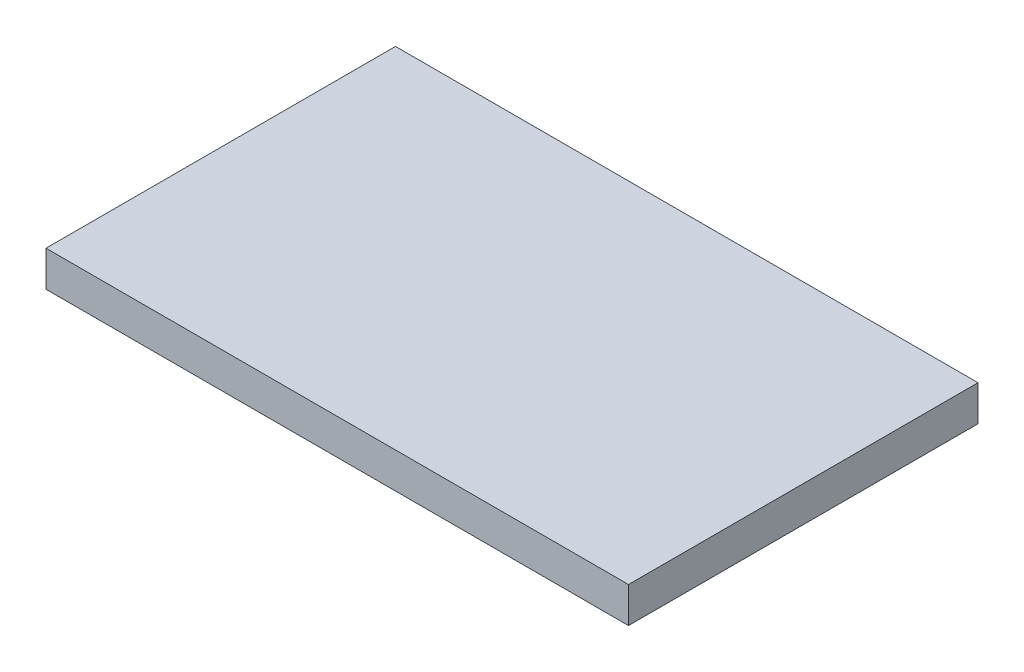
ISO-10303-21;
HEADER;
FILE_DESCRIPTION(('STEP AP214'),'2;1');
FILE_NAME('part.step','',(''),(''),'','','');
FILE_SCHEMA(('AUTOMOTIVE_DESIGN { 1 0 10303 214 1 1 1 1 }'));
ENDSEC;
DATA;
#1=APPLICATION_CONTEXT('core data for automotive mechanical design processes');
#2=APPLICATION_PROTOCOL_DEFINITION('international standard','automotive_design',2000,#1);
#3=PRODUCT_CONTEXT('',#1,'mechanical');
#4=PRODUCT('Part','Part','',(#3));
#5=PRODUCT_RELATED_PRODUCT_CATEGORY('part','',(#4));
#6=PRODUCT_DEFINITION_FORMATION('','',#4);
#7=PRODUCT_DEFINITION_CONTEXT('part definition',#1,'design');
#8=PRODUCT_DEFINITION('design','',#6,#7);
#9=PRODUCT_DEFINITION_SHAPE('','',#8);
#10=(LENGTH_UNIT() NAMED_UNIT(*) SI_UNIT(.MILLI.,.METRE.));
#11=(NAMED_UNIT(*) PLANE_ANGLE_UNIT() SI_UNIT($,.RADIAN.));
#12=(NAMED_UNIT(*) SI_UNIT($,.STERADIAN.) SOLID_ANGLE_UNIT());
#13=UNCERTAINTY_MEASURE_WITH_UNIT(LENGTH_MEASURE(1.E-05),#10,'distance_accuracy_value','');
#14=(GEOMETRIC_REPRESENTATION_CONTEXT(3) GLOBAL_UNCERTAINTY_ASSIGNED_CONTEXT((#13)) GLOBAL_UNIT_ASSIGNED_CONTEXT((#10,
#11,#12)) REPRESENTATION_CONTEXT('',''));
#15=CARTESIAN_POINT('',(0.,0.,0.));
#16=DIRECTION('',(0.,0.,1.));
#17=DIRECTION('',(1.,0.,0.));
#18=AXIS2_PLACEMENT_3D('',#15,#16,#17);
#19=CARTESIAN_POINT('',(16.375,2.,-9.825));
#20=DIRECTION('',(-1.,0.,0.));
#21=DIRECTION('',(0.,0.,1.));
#22=AXIS2_PLACEMENT_3D('',#19,#20,#21);
#23=PLANE('',#22);
#24=DIRECTION('',(0.,0.,-1.));
#25=VECTOR('',#24,1.);
#26=CARTESIAN_POINT('',(16.375,0.,-9.825));
#27=LINE('',#26,#25);
#28=CARTESIAN_POINT('',(16.375,0.,9.825));
#29=VERTEX_POINT('',#28);
#30=CARTESIAN_POINT('',(16.375,0.,-9.825));
#31=VERTEX_POINT('',#30);
#32=EDGE_CURVE('E96',#29,#31,#27,.T.);
#33=ORIENTED_EDGE('',*,*,#32,.T.);
#34=DIRECTION('',(0.,-1.,0.));
#35=VECTOR('',#34,1.);
#36=CARTESIAN_POINT('',(16.375,2.,-9.825));
#37=LINE('',#36,#35);
#38=CARTESIAN_POINT('',(16.375,2.,-9.825));
#39=VERTEX_POINT('',#38);
#40=EDGE_CURVE('E11',#39,#31,#37,.T.);
#41=ORIENTED_EDGE('',*,*,#40,.F.);
#42=DIRECTION('',(0.,0.,-1.));
#43=VECTOR('',#42,1.);
#44=CARTESIAN_POINT('',(16.375,2.,-9.825));
#45=LINE('',#44,#43);
#46=CARTESIAN_POINT('',(16.375,2.,9.825));
#47=VERTEX_POINT('',#46);
#48=EDGE_CURVE('E84',#47,#39,#45,.T.);
#49=ORIENTED_EDGE('',*,*,#48,.F.);
#50=DIRECTION('',(0.,-1.,0.));
#51=VECTOR('',#50,1.);
#52=CARTESIAN_POINT('',(16.375,2.,9.825));
#53=LINE('',#52,#51);
#54=EDGE_CURVE('E92',#47,#29,#53,.T.);
#55=ORIENTED_EDGE('',*,*,#54,.T.);
#56=EDGE_LOOP('',(#33,#41,#49,#55));
#57=FACE_BOUND('',#56,.T.);
#58=ADVANCED_FACE('F33',(#57),#23,.F.);
#59=CARTESIAN_POINT('',(-16.375,2.,-9.825));
#60=DIRECTION('',(0.,0.,1.));
#61=DIRECTION('',(1.,0.,0.));
#62=AXIS2_PLACEMENT_3D('',#59,#60,#61);
#63=PLANE('',#62);
#64=DIRECTION('',(-1.,0.,0.));
#65=VECTOR('',#64,1.);
#66=CARTESIAN_POINT('',(-16.375,0.,-9.825));
#67=LINE('',#66,#65);
#68=CARTESIAN_POINT('',(-16.375,0.,-9.825));
#69=VERTEX_POINT('',#68);
#70=EDGE_CURVE('E88',#31,#69,#67,.T.);
#71=ORIENTED_EDGE('',*,*,#70,.T.);
#72=DIRECTION('',(0.,-1.,0.));
#73=VECTOR('',#72,1.);
#74=CARTESIAN_POINT('',(-16.375,2.,-9.825));
#75=LINE('',#74,#73);
#76=CARTESIAN_POINT('',(-16.375,2.,-9.825));
#77=VERTEX_POINT('',#76);
#78=EDGE_CURVE('E41',#77,#69,#75,.T.);
#79=ORIENTED_EDGE('',*,*,#78,.F.);
#80=DIRECTION('',(-1.,0.,0.));
#81=VECTOR('',#80,1.);
#82=CARTESIAN_POINT('',(-16.375,2.,-9.825));
#83=LINE('',#82,#81);
#84=EDGE_CURVE('E79',#39,#77,#83,.T.);
#85=ORIENTED_EDGE('',*,*,#84,.F.);
#86=ORIENTED_EDGE('',*,*,#40,.T.);
#87=EDGE_LOOP('',(#71,#79,#85,#86));
#88=FACE_BOUND('',#87,.T.);
#89=ADVANCED_FACE('F87',(#88),#63,.F.);
#90=CARTESIAN_POINT('',(-16.375,2.,-9.825));
#91=DIRECTION('',(1.,0.,0.));
#92=DIRECTION('',(0.,0.,-1.));
#93=AXIS2_PLACEMENT_3D('',#90,#91,#92);
#94=PLANE('',#93);
#95=DIRECTION('',(0.,0.,1.));
#96=VECTOR('',#95,1.);
#97=CARTESIAN_POINT('',(-16.375,0.,-9.825));
#98=LINE('',#97,#96);
#99=CARTESIAN_POINT('',(-16.375,0.,9.825));
#100=VERTEX_POINT('',#99);
#101=EDGE_CURVE('E66',#69,#100,#98,.T.);
#102=ORIENTED_EDGE('',*,*,#101,.T.);
#103=DIRECTION('',(0.,-1.,0.));
#104=VECTOR('',#103,1.);
#105=CARTESIAN_POINT('',(-16.375,2.,9.825));
#106=LINE('',#105,#104);
#107=CARTESIAN_POINT('',(-16.375,2.,9.825));
#108=VERTEX_POINT('',#107);
#109=EDGE_CURVE('E89',#108,#100,#106,.T.);
#110=ORIENTED_EDGE('',*,*,#109,.F.);
#111=DIRECTION('',(0.,0.,1.));
#112=VECTOR('',#111,1.);
#113=CARTESIAN_POINT('',(-16.375,2.,-9.825));
#114=LINE('',#113,#112);
#115=EDGE_CURVE('E82',#77,#108,#114,.T.);
#116=ORIENTED_EDGE('',*,*,#115,.F.);
#117=ORIENTED_EDGE('',*,*,#78,.T.);
#118=EDGE_LOOP('',(#102,#110,#116,#117));
#119=FACE_BOUND('',#118,.T.);
#120=ADVANCED_FACE('F90',(#119),#94,.F.);
#121=CARTESIAN_POINT('',(-16.375,2.,9.825));
#122=DIRECTION('',(0.,0.,-1.));
#123=DIRECTION('',(-1.,0.,0.));
#124=AXIS2_PLACEMENT_3D('',#121,#122,#123);
#125=PLANE('',#124);
#126=DIRECTION('',(1.,0.,0.));
#127=VECTOR('',#126,1.);
#128=CARTESIAN_POINT('',(-16.375,0.,9.825));
#129=LINE('',#128,#127);
#130=EDGE_CURVE('E72',#100,#29,#129,.T.);
#131=ORIENTED_EDGE('',*,*,#130,.T.);
#132=ORIENTED_EDGE('',*,*,#54,.F.);
#133=DIRECTION('',(1.,0.,0.));
#134=VECTOR('',#133,1.);
#135=CARTESIAN_POINT('',(-16.375,2.,9.825));
#136=LINE('',#135,#134);
#137=EDGE_CURVE('E49',#108,#47,#136,.T.);
#138=ORIENTED_EDGE('',*,*,#137,.F.);
#139=ORIENTED_EDGE('',*,*,#109,.T.);
#140=EDGE_LOOP('',(#131,#132,#138,#139));
#141=FACE_BOUND('',#140,.T.);
#142=ADVANCED_FACE('F103',(#141),#125,.F.);
#143=CARTESIAN_POINT('',(0.,2.,0.));
#144=DIRECTION('',(0.,1.,0.));
#145=DIRECTION('',(0.,0.,1.));
#146=AXIS2_PLACEMENT_3D('',#143,#144,#145);
#147=PLANE('',#146);
#148=ORIENTED_EDGE('',*,*,#48,.T.);
#149=ORIENTED_EDGE('',*,*,#84,.T.);
#150=ORIENTED_EDGE('',*,*,#115,.T.);
#151=ORIENTED_EDGE('',*,*,#137,.T.);
#152=EDGE_LOOP('',(#148,#149,#150,#151));
#153=FACE_BOUND('',#152,.T.);
#154=ADVANCED_FACE('F80',(#153),#147,.T.);
#155=CARTESIAN_POINT('',(0.,0.,0.));
#156=DIRECTION('',(0.,1.,0.));
#157=DIRECTION('',(0.,0.,1.));
#158=AXIS2_PLACEMENT_3D('',#155,#156,#157);
#159=PLANE('',#158);
#160=ORIENTED_EDGE('',*,*,#32,.F.);
#161=ORIENTED_EDGE('',*,*,#130,.F.);
#162=ORIENTED_EDGE('',*,*,#101,.F.);
#163=ORIENTED_EDGE('',*,*,#70,.F.);
#164=EDGE_LOOP('',(#160,#161,#162,#163));
#165=FACE_BOUND('',#164,.T.);
#166=ADVANCED_FACE('F106',(#165),#159,.F.);
#167=CLOSED_SHELL('',(#58,#89,#120,#142,#154,#166));
#168=MANIFOLD_SOLID_BREP('B2',#167);
#169=ADVANCED_BREP_SHAPE_REPRESENTATION('',(#18,#168),#14);
#170=SHAPE_DEFINITION_REPRESENTATION(#9,#169);
ENDSEC;
END-ISO-10303-21;
